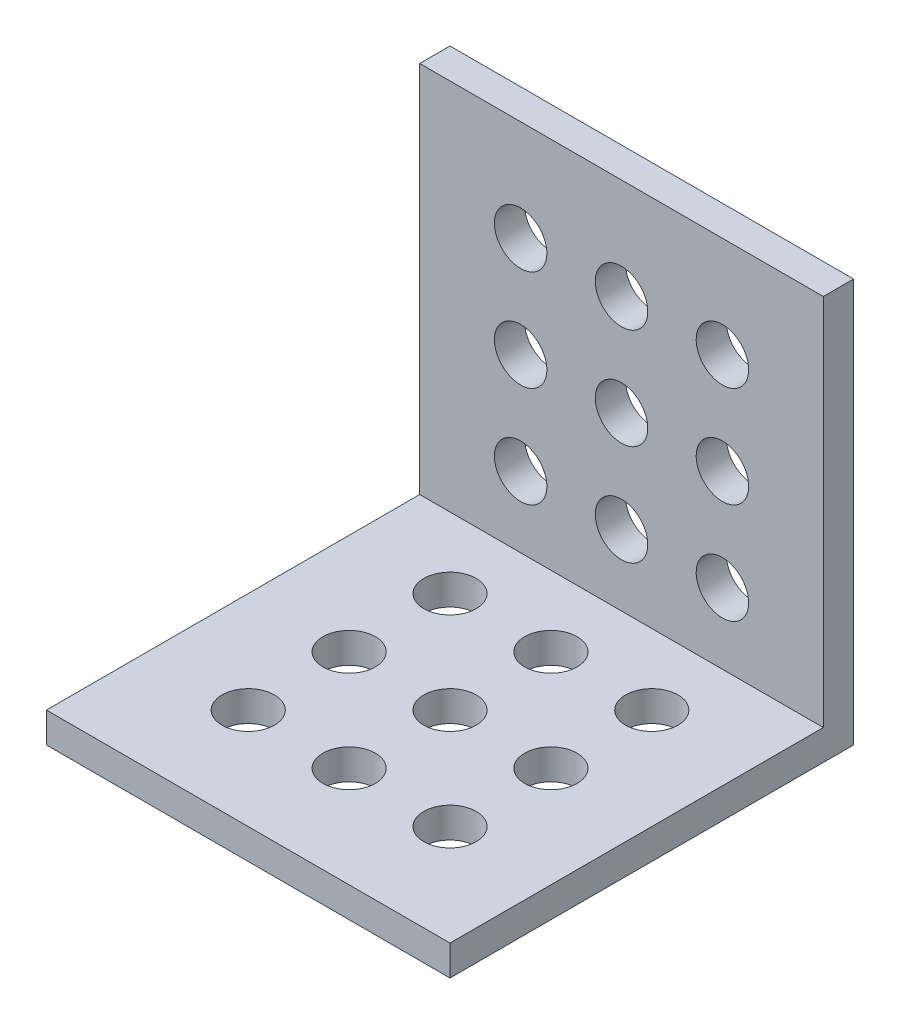
ISO-10303-21;
HEADER;
FILE_DESCRIPTION(('STEP AP214'),'2;1');
FILE_NAME('part.step','',(''),(''),'','','');
FILE_SCHEMA(('AUTOMOTIVE_DESIGN { 1 0 10303 214 1 1 1 1 }'));
ENDSEC;
DATA;
#1=APPLICATION_CONTEXT('core data for automotive mechanical design processes');
#2=APPLICATION_PROTOCOL_DEFINITION('international standard','automotive_design',2000,#1);
#3=PRODUCT_CONTEXT('',#1,'mechanical');
#4=PRODUCT('Part','Part','',(#3));
#5=PRODUCT_RELATED_PRODUCT_CATEGORY('part','',(#4));
#6=PRODUCT_DEFINITION_FORMATION('','',#4);
#7=PRODUCT_DEFINITION_CONTEXT('part definition',#1,'design');
#8=PRODUCT_DEFINITION('design','',#6,#7);
#9=PRODUCT_DEFINITION_SHAPE('','',#8);
#10=(LENGTH_UNIT() NAMED_UNIT(*) SI_UNIT(.MILLI.,.METRE.));
#11=(NAMED_UNIT(*) PLANE_ANGLE_UNIT() SI_UNIT($,.RADIAN.));
#12=(NAMED_UNIT(*) SI_UNIT($,.STERADIAN.) SOLID_ANGLE_UNIT());
#13=UNCERTAINTY_MEASURE_WITH_UNIT(LENGTH_MEASURE(1.E-05),#10,'distance_accuracy_value','');
#14=(GEOMETRIC_REPRESENTATION_CONTEXT(3) GLOBAL_UNCERTAINTY_ASSIGNED_CONTEXT((#13)) GLOBAL_UNIT_ASSIGNED_CONTEXT((#10,
#11,#12)) REPRESENTATION_CONTEXT('',''));
#15=CARTESIAN_POINT('',(0.,0.,0.));
#16=DIRECTION('',(0.,0.,1.));
#17=DIRECTION('',(1.,0.,0.));
#18=AXIS2_PLACEMENT_3D('',#15,#16,#17);
#19=CARTESIAN_POINT('',(-40.,0.,-40.));
#20=DIRECTION('',(0.,-1.,0.));
#21=DIRECTION('',(0.,0.,-1.));
#22=AXIS2_PLACEMENT_3D('',#19,#20,#21);
#23=PLANE('',#22);
#24=CARTESIAN_POINT('',(-20.,0.,-10.));
#25=DIRECTION('',(0.,1.,0.));
#26=DIRECTION('',(0.,0.,1.));
#27=AXIS2_PLACEMENT_3D('',#24,#25,#26);
#28=CIRCLE('',#27,2.6);
#29=CARTESIAN_POINT('',(-20.,0.,-7.40000000000001));
#30=VERTEX_POINT('',#29);
#31=EDGE_CURVE('E248',#30,#30,#28,.T.);
#32=ORIENTED_EDGE('',*,*,#31,.T.);
#33=EDGE_LOOP('',(#32));
#34=FACE_BOUND('',#33,.T.);
#35=CARTESIAN_POINT('',(-10.,0.,-10.));
#36=DIRECTION('',(0.,1.,0.));
#37=DIRECTION('',(0.,0.,1.));
#38=AXIS2_PLACEMENT_3D('',#35,#36,#37);
#39=CIRCLE('',#38,2.6);
#40=CARTESIAN_POINT('',(-10.,0.,-7.4));
#41=VERTEX_POINT('',#40);
#42=EDGE_CURVE('E254',#41,#41,#39,.T.);
#43=ORIENTED_EDGE('',*,*,#42,.T.);
#44=EDGE_LOOP('',(#43));
#45=FACE_BOUND('',#44,.T.);
#46=CARTESIAN_POINT('',(-20.,0.,-20.));
#47=DIRECTION('',(0.,1.,0.));
#48=DIRECTION('',(0.,0.,1.));
#49=AXIS2_PLACEMENT_3D('',#46,#47,#48);
#50=CIRCLE('',#49,2.6);
#51=CARTESIAN_POINT('',(-20.,0.,-17.4));
#52=VERTEX_POINT('',#51);
#53=EDGE_CURVE('E260',#52,#52,#50,.T.);
#54=ORIENTED_EDGE('',*,*,#53,.T.);
#55=EDGE_LOOP('',(#54));
#56=FACE_BOUND('',#55,.T.);
#57=CARTESIAN_POINT('',(-10.,0.,-20.));
#58=DIRECTION('',(0.,1.,0.));
#59=DIRECTION('',(0.,0.,1.));
#60=AXIS2_PLACEMENT_3D('',#57,#58,#59);
#61=CIRCLE('',#60,2.6);
#62=CARTESIAN_POINT('',(-10.,0.,-17.4));
#63=VERTEX_POINT('',#62);
#64=EDGE_CURVE('E226',#63,#63,#61,.T.);
#65=ORIENTED_EDGE('',*,*,#64,.T.);
#66=EDGE_LOOP('',(#65));
#67=FACE_BOUND('',#66,.T.);
#68=CARTESIAN_POINT('',(-20.0000000000001,0.,-30.));
#69=DIRECTION('',(0.,1.,0.));
#70=DIRECTION('',(0.,0.,1.));
#71=AXIS2_PLACEMENT_3D('',#68,#69,#70);
#72=CIRCLE('',#71,2.6);
#73=CARTESIAN_POINT('',(-20.0000000000001,0.,-27.4));
#74=VERTEX_POINT('',#73);
#75=EDGE_CURVE('E227',#74,#74,#72,.T.);
#76=ORIENTED_EDGE('',*,*,#75,.T.);
#77=EDGE_LOOP('',(#76));
#78=FACE_BOUND('',#77,.T.);
#79=CARTESIAN_POINT('',(-10.0000000000001,0.,-30.));
#80=DIRECTION('',(0.,1.,0.));
#81=DIRECTION('',(0.,0.,1.));
#82=AXIS2_PLACEMENT_3D('',#79,#80,#81);
#83=CIRCLE('',#82,2.6);
#84=CARTESIAN_POINT('',(-10.0000000000001,0.,-27.4));
#85=VERTEX_POINT('',#84);
#86=EDGE_CURVE('E233',#85,#85,#83,.T.);
#87=ORIENTED_EDGE('',*,*,#86,.T.);
#88=EDGE_LOOP('',(#87));
#89=FACE_BOUND('',#88,.T.);
#90=CARTESIAN_POINT('',(-30.,0.,-20.));
#91=DIRECTION('',(0.,1.,0.));
#92=DIRECTION('',(0.,0.,1.));
#93=AXIS2_PLACEMENT_3D('',#90,#91,#92);
#94=CIRCLE('',#93,2.6);
#95=CARTESIAN_POINT('',(-30.,0.,-17.4));
#96=VERTEX_POINT('',#95);
#97=EDGE_CURVE('E239',#96,#96,#94,.T.);
#98=ORIENTED_EDGE('',*,*,#97,.T.);
#99=EDGE_LOOP('',(#98));
#100=FACE_BOUND('',#99,.T.);
#101=CARTESIAN_POINT('',(-30.0000000000001,0.,-30.));
#102=DIRECTION('',(0.,1.,0.));
#103=DIRECTION('',(0.,0.,1.));
#104=AXIS2_PLACEMENT_3D('',#101,#102,#103);
#105=CIRCLE('',#104,2.6);
#106=CARTESIAN_POINT('',(-30.0000000000001,0.,-27.4));
#107=VERTEX_POINT('',#106);
#108=EDGE_CURVE('E211',#107,#107,#105,.T.);
#109=ORIENTED_EDGE('',*,*,#108,.T.);
#110=EDGE_LOOP('',(#109));
#111=FACE_BOUND('',#110,.T.);
#112=CARTESIAN_POINT('',(-30.,0.,-10.));
#113=DIRECTION('',(0.,1.,0.));
#114=DIRECTION('',(0.,0.,1.));
#115=AXIS2_PLACEMENT_3D('',#112,#113,#114);
#116=CIRCLE('',#115,2.6);
#117=CARTESIAN_POINT('',(-30.,0.,-7.4));
#118=VERTEX_POINT('',#117);
#119=EDGE_CURVE('E132',#118,#118,#116,.T.);
#120=ORIENTED_EDGE('',*,*,#119,.T.);
#121=EDGE_LOOP('',(#120));
#122=FACE_BOUND('',#121,.T.);
#123=DIRECTION('',(0.,0.,-1.));
#124=VECTOR('',#123,1.);
#125=CARTESIAN_POINT('',(0.,0.,-40.));
#126=LINE('',#125,#124);
#127=CARTESIAN_POINT('',(0.,0.,0.));
#128=VERTEX_POINT('',#127);
#129=CARTESIAN_POINT('',(0.,0.,-40.));
#130=VERTEX_POINT('',#129);
#131=EDGE_CURVE('E128',#128,#130,#126,.T.);
#132=ORIENTED_EDGE('',*,*,#131,.F.);
#133=DIRECTION('',(1.,0.,0.));
#134=VECTOR('',#133,1.);
#135=CARTESIAN_POINT('',(-40.,0.,0.));
#136=LINE('',#135,#134);
#137=CARTESIAN_POINT('',(-40.,0.,0.));
#138=VERTEX_POINT('',#137);
#139=EDGE_CURVE('E11',#138,#128,#136,.T.);
#140=ORIENTED_EDGE('',*,*,#139,.F.);
#141=DIRECTION('',(0.,0.,-1.));
#142=VECTOR('',#141,1.);
#143=CARTESIAN_POINT('',(-40.,0.,-40.));
#144=LINE('',#143,#142);
#145=CARTESIAN_POINT('',(-40.,0.,-40.));
#146=VERTEX_POINT('',#145);
#147=EDGE_CURVE('E143',#138,#146,#144,.T.);
#148=ORIENTED_EDGE('',*,*,#147,.T.);
#149=DIRECTION('',(1.,0.,0.));
#150=VECTOR('',#149,1.);
#151=CARTESIAN_POINT('',(-40.,0.,-40.));
#152=LINE('',#151,#150);
#153=EDGE_CURVE('E46',#146,#130,#152,.T.);
#154=ORIENTED_EDGE('',*,*,#153,.T.);
#155=EDGE_LOOP('',(#132,#140,#148,#154));
#156=FACE_BOUND('',#155,.T.);
#157=ADVANCED_FACE('F43',(#34,#45,#56,#67,#78,#89,#100,#111,#122,#156),#23,.T.);
#158=CARTESIAN_POINT('',(-40.,0.,0.));
#159=DIRECTION('',(0.,0.,1.));
#160=DIRECTION('',(1.,0.,0.));
#161=AXIS2_PLACEMENT_3D('',#158,#159,#160);
#162=PLANE('',#161);
#163=DIRECTION('',(0.,-1.,0.));
#164=VECTOR('',#163,1.);
#165=CARTESIAN_POINT('',(0.,0.,0.));
#166=LINE('',#165,#164);
#167=CARTESIAN_POINT('',(0.,3.,0.));
#168=VERTEX_POINT('',#167);
#169=EDGE_CURVE('E141',#168,#128,#166,.T.);
#170=ORIENTED_EDGE('',*,*,#169,.F.);
#171=DIRECTION('',(1.,0.,0.));
#172=VECTOR('',#171,1.);
#173=CARTESIAN_POINT('',(-40.,3.,0.));
#174=LINE('',#173,#172);
#175=CARTESIAN_POINT('',(-40.,3.,0.));
#176=VERTEX_POINT('',#175);
#177=EDGE_CURVE('E52',#176,#168,#174,.T.);
#178=ORIENTED_EDGE('',*,*,#177,.F.);
#179=DIRECTION('',(0.,-1.,0.));
#180=VECTOR('',#179,1.);
#181=CARTESIAN_POINT('',(-40.,0.,0.));
#182=LINE('',#181,#180);
#183=EDGE_CURVE('E118',#176,#138,#182,.T.);
#184=ORIENTED_EDGE('',*,*,#183,.T.);
#185=ORIENTED_EDGE('',*,*,#139,.T.);
#186=EDGE_LOOP('',(#170,#178,#184,#185));
#187=FACE_BOUND('',#186,.T.);
#188=ADVANCED_FACE('F151',(#187),#162,.T.);
#189=CARTESIAN_POINT('',(-40.,3.,0.));
#190=DIRECTION('',(0.,1.,0.));
#191=DIRECTION('',(0.,0.,1.));
#192=AXIS2_PLACEMENT_3D('',#189,#190,#191);
#193=PLANE('',#192);
#194=CARTESIAN_POINT('',(-20.,3.,-10.));
#195=DIRECTION('',(0.,1.,0.));
#196=DIRECTION('',(0.,0.,1.));
#197=AXIS2_PLACEMENT_3D('',#194,#195,#196);
#198=CIRCLE('',#197,2.6);
#199=CARTESIAN_POINT('',(-20.,3.,-7.40000000000001));
#200=VERTEX_POINT('',#199);
#201=EDGE_CURVE('E244',#200,#200,#198,.T.);
#202=ORIENTED_EDGE('',*,*,#201,.F.);
#203=EDGE_LOOP('',(#202));
#204=FACE_BOUND('',#203,.T.);
#205=CARTESIAN_POINT('',(-10.,3.,-10.));
#206=DIRECTION('',(0.,1.,0.));
#207=DIRECTION('',(0.,0.,1.));
#208=AXIS2_PLACEMENT_3D('',#205,#206,#207);
#209=CIRCLE('',#208,2.6);
#210=CARTESIAN_POINT('',(-10.,3.,-7.4));
#211=VERTEX_POINT('',#210);
#212=EDGE_CURVE('E251',#211,#211,#209,.T.);
#213=ORIENTED_EDGE('',*,*,#212,.F.);
#214=EDGE_LOOP('',(#213));
#215=FACE_BOUND('',#214,.T.);
#216=CARTESIAN_POINT('',(-20.,3.,-20.));
#217=DIRECTION('',(0.,1.,0.));
#218=DIRECTION('',(0.,0.,1.));
#219=AXIS2_PLACEMENT_3D('',#216,#217,#218);
#220=CIRCLE('',#219,2.6);
#221=CARTESIAN_POINT('',(-20.,3.,-17.4));
#222=VERTEX_POINT('',#221);
#223=EDGE_CURVE('E257',#222,#222,#220,.T.);
#224=ORIENTED_EDGE('',*,*,#223,.F.);
#225=EDGE_LOOP('',(#224));
#226=FACE_BOUND('',#225,.T.);
#227=CARTESIAN_POINT('',(-10.,3.,-20.));
#228=DIRECTION('',(0.,1.,0.));
#229=DIRECTION('',(0.,0.,1.));
#230=AXIS2_PLACEMENT_3D('',#227,#228,#229);
#231=CIRCLE('',#230,2.6);
#232=CARTESIAN_POINT('',(-10.,3.,-17.4));
#233=VERTEX_POINT('',#232);
#234=EDGE_CURVE('E263',#233,#233,#231,.T.);
#235=ORIENTED_EDGE('',*,*,#234,.F.);
#236=EDGE_LOOP('',(#235));
#237=FACE_BOUND('',#236,.T.);
#238=CARTESIAN_POINT('',(-20.0000000000001,3.,-30.));
#239=DIRECTION('',(0.,1.,0.));
#240=DIRECTION('',(0.,0.,1.));
#241=AXIS2_PLACEMENT_3D('',#238,#239,#240);
#242=CIRCLE('',#241,2.6);
#243=CARTESIAN_POINT('',(-20.0000000000001,3.,-27.4));
#244=VERTEX_POINT('',#243);
#245=EDGE_CURVE('E223',#244,#244,#242,.T.);
#246=ORIENTED_EDGE('',*,*,#245,.F.);
#247=EDGE_LOOP('',(#246));
#248=FACE_BOUND('',#247,.T.);
#249=CARTESIAN_POINT('',(-10.0000000000001,3.,-30.));
#250=DIRECTION('',(0.,1.,0.));
#251=DIRECTION('',(0.,0.,1.));
#252=AXIS2_PLACEMENT_3D('',#249,#250,#251);
#253=CIRCLE('',#252,2.6);
#254=CARTESIAN_POINT('',(-10.0000000000001,3.,-27.4));
#255=VERTEX_POINT('',#254);
#256=EDGE_CURVE('E230',#255,#255,#253,.T.);
#257=ORIENTED_EDGE('',*,*,#256,.F.);
#258=EDGE_LOOP('',(#257));
#259=FACE_BOUND('',#258,.T.);
#260=CARTESIAN_POINT('',(-30.,3.,-20.));
#261=DIRECTION('',(0.,1.,0.));
#262=DIRECTION('',(0.,0.,1.));
#263=AXIS2_PLACEMENT_3D('',#260,#261,#262);
#264=CIRCLE('',#263,2.6);
#265=CARTESIAN_POINT('',(-30.,3.,-17.4));
#266=VERTEX_POINT('',#265);
#267=EDGE_CURVE('E236',#266,#266,#264,.T.);
#268=ORIENTED_EDGE('',*,*,#267,.F.);
#269=EDGE_LOOP('',(#268));
#270=FACE_BOUND('',#269,.T.);
#271=CARTESIAN_POINT('',(-30.0000000000001,3.,-30.));
#272=DIRECTION('',(0.,1.,0.));
#273=DIRECTION('',(0.,0.,1.));
#274=AXIS2_PLACEMENT_3D('',#271,#272,#273);
#275=CIRCLE('',#274,2.6);
#276=CARTESIAN_POINT('',(-30.0000000000001,3.,-27.4));
#277=VERTEX_POINT('',#276);
#278=EDGE_CURVE('E215',#277,#277,#275,.T.);
#279=ORIENTED_EDGE('',*,*,#278,.F.);
#280=EDGE_LOOP('',(#279));
#281=FACE_BOUND('',#280,.T.);
#282=CARTESIAN_POINT('',(-30.,3.,-10.));
#283=DIRECTION('',(0.,1.,0.));
#284=DIRECTION('',(0.,0.,1.));
#285=AXIS2_PLACEMENT_3D('',#282,#283,#284);
#286=CIRCLE('',#285,2.6);
#287=CARTESIAN_POINT('',(-30.,3.,-7.4));
#288=VERTEX_POINT('',#287);
#289=EDGE_CURVE('E247',#288,#288,#286,.T.);
#290=ORIENTED_EDGE('',*,*,#289,.F.);
#291=EDGE_LOOP('',(#290));
#292=FACE_BOUND('',#291,.T.);
#293=DIRECTION('',(0.,0.,1.));
#294=VECTOR('',#293,1.);
#295=CARTESIAN_POINT('',(0.,3.,0.));
#296=LINE('',#295,#294);
#297=CARTESIAN_POINT('',(0.,3.,-37.));
#298=VERTEX_POINT('',#297);
#299=EDGE_CURVE('E105',#298,#168,#296,.T.);
#300=ORIENTED_EDGE('',*,*,#299,.F.);
#301=DIRECTION('',(1.,0.,0.));
#302=VECTOR('',#301,1.);
#303=CARTESIAN_POINT('',(-40.,3.,-37.));
#304=LINE('',#303,#302);
#305=CARTESIAN_POINT('',(-40.,3.,-37.));
#306=VERTEX_POINT('',#305);
#307=EDGE_CURVE('E100',#306,#298,#304,.T.);
#308=ORIENTED_EDGE('',*,*,#307,.F.);
#309=DIRECTION('',(0.,0.,1.));
#310=VECTOR('',#309,1.);
#311=CARTESIAN_POINT('',(-40.,3.,0.));
#312=LINE('',#311,#310);
#313=EDGE_CURVE('E103',#306,#176,#312,.T.);
#314=ORIENTED_EDGE('',*,*,#313,.T.);
#315=ORIENTED_EDGE('',*,*,#177,.T.);
#316=EDGE_LOOP('',(#300,#308,#314,#315));
#317=FACE_BOUND('',#316,.T.);
#318=ADVANCED_FACE('F102',(#204,#215,#226,#237,#248,#259,#270,#281,#292,#317),#193,.T.);
#319=CARTESIAN_POINT('',(-40.,3.,-37.));
#320=DIRECTION('',(0.,0.,1.));
#321=DIRECTION('',(1.,0.,0.));
#322=AXIS2_PLACEMENT_3D('',#319,#320,#321);
#323=PLANE('',#322);
#324=CARTESIAN_POINT('',(-20.,30.,-36.9999999999999));
#325=DIRECTION('',(0.,0.,-1.));
#326=DIRECTION('',(0.,1.,0.));
#327=AXIS2_PLACEMENT_3D('',#324,#325,#326);
#328=CIRCLE('',#327,2.6);
#329=CARTESIAN_POINT('',(-20.,32.6,-36.9999999999999));
#330=VERTEX_POINT('',#329);
#331=EDGE_CURVE('E373',#330,#330,#328,.T.);
#332=ORIENTED_EDGE('',*,*,#331,.T.);
#333=EDGE_LOOP('',(#332));
#334=FACE_BOUND('',#333,.T.);
#335=CARTESIAN_POINT('',(-10.,30.,-36.9999999999999));
#336=DIRECTION('',(0.,0.,-1.));
#337=DIRECTION('',(0.,1.,0.));
#338=AXIS2_PLACEMENT_3D('',#335,#336,#337);
#339=CIRCLE('',#338,2.6);
#340=CARTESIAN_POINT('',(-10.,32.6,-36.9999999999999));
#341=VERTEX_POINT('',#340);
#342=EDGE_CURVE('E377',#341,#341,#339,.T.);
#343=ORIENTED_EDGE('',*,*,#342,.T.);
#344=EDGE_LOOP('',(#343));
#345=FACE_BOUND('',#344,.T.);
#346=CARTESIAN_POINT('',(-20.,20.,-36.9999999999999));
#347=DIRECTION('',(0.,0.,-1.));
#348=DIRECTION('',(0.,1.,0.));
#349=AXIS2_PLACEMENT_3D('',#346,#347,#348);
#350=CIRCLE('',#349,2.6);
#351=CARTESIAN_POINT('',(-20.,22.6,-36.9999999999999));
#352=VERTEX_POINT('',#351);
#353=EDGE_CURVE('E381',#352,#352,#350,.T.);
#354=ORIENTED_EDGE('',*,*,#353,.T.);
#355=EDGE_LOOP('',(#354));
#356=FACE_BOUND('',#355,.T.);
#357=CARTESIAN_POINT('',(-10.,20.,-36.9999999999999));
#358=DIRECTION('',(0.,0.,-1.));
#359=DIRECTION('',(0.,1.,0.));
#360=AXIS2_PLACEMENT_3D('',#357,#358,#359);
#361=CIRCLE('',#360,2.6);
#362=CARTESIAN_POINT('',(-10.,22.6,-36.9999999999999));
#363=VERTEX_POINT('',#362);
#364=EDGE_CURVE('E220',#363,#363,#361,.T.);
#365=ORIENTED_EDGE('',*,*,#364,.T.);
#366=EDGE_LOOP('',(#365));
#367=FACE_BOUND('',#366,.T.);
#368=CARTESIAN_POINT('',(-20.0000000000001,9.99999999999998,-37.));
#369=DIRECTION('',(0.,0.,-1.));
#370=DIRECTION('',(0.,1.,0.));
#371=AXIS2_PLACEMENT_3D('',#368,#369,#370);
#372=CIRCLE('',#371,2.6);
#373=CARTESIAN_POINT('',(-20.0000000000001,12.6,-37.));
#374=VERTEX_POINT('',#373);
#375=EDGE_CURVE('E355',#374,#374,#372,.T.);
#376=ORIENTED_EDGE('',*,*,#375,.T.);
#377=EDGE_LOOP('',(#376));
#378=FACE_BOUND('',#377,.T.);
#379=CARTESIAN_POINT('',(-10.0000000000001,9.99999999999998,-37.));
#380=DIRECTION('',(0.,0.,-1.));
#381=DIRECTION('',(0.,1.,0.));
#382=AXIS2_PLACEMENT_3D('',#379,#380,#381);
#383=CIRCLE('',#382,2.6);
#384=CARTESIAN_POINT('',(-10.0000000000001,12.6,-37.));
#385=VERTEX_POINT('',#384);
#386=EDGE_CURVE('E359',#385,#385,#383,.T.);
#387=ORIENTED_EDGE('',*,*,#386,.T.);
#388=EDGE_LOOP('',(#387));
#389=FACE_BOUND('',#388,.T.);
#390=CARTESIAN_POINT('',(-30.,20.,-36.9999999999999));
#391=DIRECTION('',(0.,0.,-1.));
#392=DIRECTION('',(0.,1.,0.));
#393=AXIS2_PLACEMENT_3D('',#390,#391,#392);
#394=CIRCLE('',#393,2.6);
#395=CARTESIAN_POINT('',(-30.,22.6,-36.9999999999999));
#396=VERTEX_POINT('',#395);
#397=EDGE_CURVE('E365',#396,#396,#394,.T.);
#398=ORIENTED_EDGE('',*,*,#397,.T.);
#399=EDGE_LOOP('',(#398));
#400=FACE_BOUND('',#399,.T.);
#401=CARTESIAN_POINT('',(-30.0000000000001,9.99999999999998,-37.));
#402=DIRECTION('',(0.,0.,-1.));
#403=DIRECTION('',(0.,1.,0.));
#404=AXIS2_PLACEMENT_3D('',#401,#402,#403);
#405=CIRCLE('',#404,2.6);
#406=CARTESIAN_POINT('',(-30.0000000000001,12.6,-37.));
#407=VERTEX_POINT('',#406);
#408=EDGE_CURVE('E369',#407,#407,#405,.T.);
#409=ORIENTED_EDGE('',*,*,#408,.T.);
#410=EDGE_LOOP('',(#409));
#411=FACE_BOUND('',#410,.T.);
#412=CARTESIAN_POINT('',(-30.,30.,-36.9999999999999));
#413=DIRECTION('',(0.,0.,-1.));
#414=DIRECTION('',(0.,1.,0.));
#415=AXIS2_PLACEMENT_3D('',#412,#413,#414);
#416=CIRCLE('',#415,2.6);
#417=CARTESIAN_POINT('',(-30.,32.6,-36.9999999999999));
#418=VERTEX_POINT('',#417);
#419=EDGE_CURVE('E212',#418,#418,#416,.T.);
#420=ORIENTED_EDGE('',*,*,#419,.T.);
#421=EDGE_LOOP('',(#420));
#422=FACE_BOUND('',#421,.T.);
#423=DIRECTION('',(0.,-1.,0.));
#424=VECTOR('',#423,1.);
#425=CARTESIAN_POINT('',(0.,3.,-37.));
#426=LINE('',#425,#424);
#427=CARTESIAN_POINT('',(0.,40.,-37.));
#428=VERTEX_POINT('',#427);
#429=EDGE_CURVE('E138',#428,#298,#426,.T.);
#430=ORIENTED_EDGE('',*,*,#429,.F.);
#431=DIRECTION('',(1.,0.,0.));
#432=VECTOR('',#431,1.);
#433=CARTESIAN_POINT('',(-40.,40.,-37.));
#434=LINE('',#433,#432);
#435=CARTESIAN_POINT('',(-40.,40.,-37.));
#436=VERTEX_POINT('',#435);
#437=EDGE_CURVE('E110',#436,#428,#434,.T.);
#438=ORIENTED_EDGE('',*,*,#437,.F.);
#439=DIRECTION('',(0.,-1.,0.));
#440=VECTOR('',#439,1.);
#441=CARTESIAN_POINT('',(-40.,3.,-37.));
#442=LINE('',#441,#440);
#443=EDGE_CURVE('E116',#436,#306,#442,.T.);
#444=ORIENTED_EDGE('',*,*,#443,.T.);
#445=ORIENTED_EDGE('',*,*,#307,.T.);
#446=EDGE_LOOP('',(#430,#438,#444,#445));
#447=FACE_BOUND('',#446,.T.);
#448=ADVANCED_FACE('F120',(#334,#345,#356,#367,#378,#389,#400,#411,#422,#447),#323,.T.);
#449=CARTESIAN_POINT('',(-40.,40.,-37.));
#450=DIRECTION('',(0.,1.,0.));
#451=DIRECTION('',(0.,0.,1.));
#452=AXIS2_PLACEMENT_3D('',#449,#450,#451);
#453=PLANE('',#452);
#454=DIRECTION('',(0.,0.,1.));
#455=VECTOR('',#454,1.);
#456=CARTESIAN_POINT('',(0.,40.,-37.));
#457=LINE('',#456,#455);
#458=CARTESIAN_POINT('',(0.,40.,-40.));
#459=VERTEX_POINT('',#458);
#460=EDGE_CURVE('E135',#459,#428,#457,.T.);
#461=ORIENTED_EDGE('',*,*,#460,.F.);
#462=DIRECTION('',(1.,0.,0.));
#463=VECTOR('',#462,1.);
#464=CARTESIAN_POINT('',(-40.,40.,-40.));
#465=LINE('',#464,#463);
#466=CARTESIAN_POINT('',(-40.,40.,-40.));
#467=VERTEX_POINT('',#466);
#468=EDGE_CURVE('E146',#467,#459,#465,.T.);
#469=ORIENTED_EDGE('',*,*,#468,.F.);
#470=DIRECTION('',(0.,0.,1.));
#471=VECTOR('',#470,1.);
#472=CARTESIAN_POINT('',(-40.,40.,-37.));
#473=LINE('',#472,#471);
#474=EDGE_CURVE('E121',#467,#436,#473,.T.);
#475=ORIENTED_EDGE('',*,*,#474,.T.);
#476=ORIENTED_EDGE('',*,*,#437,.T.);
#477=EDGE_LOOP('',(#461,#469,#475,#476));
#478=FACE_BOUND('',#477,.T.);
#479=ADVANCED_FACE('F166',(#478),#453,.T.);
#480=CARTESIAN_POINT('',(-40.,40.,-40.));
#481=DIRECTION('',(0.,0.,-1.));
#482=DIRECTION('',(0.,1.,0.));
#483=AXIS2_PLACEMENT_3D('',#480,#481,#482);
#484=PLANE('',#483);
#485=CARTESIAN_POINT('',(-20.,30.,-40.));
#486=DIRECTION('',(0.,0.,-1.));
#487=DIRECTION('',(0.,1.,0.));
#488=AXIS2_PLACEMENT_3D('',#485,#486,#487);
#489=CIRCLE('',#488,2.6);
#490=CARTESIAN_POINT('',(-20.,32.6,-40.));
#491=VERTEX_POINT('',#490);
#492=EDGE_CURVE('E178',#491,#491,#489,.T.);
#493=ORIENTED_EDGE('',*,*,#492,.F.);
#494=EDGE_LOOP('',(#493));
#495=FACE_BOUND('',#494,.T.);
#496=CARTESIAN_POINT('',(-10.,30.,-40.));
#497=DIRECTION('',(0.,0.,-1.));
#498=DIRECTION('',(0.,1.,0.));
#499=AXIS2_PLACEMENT_3D('',#496,#497,#498);
#500=CIRCLE('',#499,2.6);
#501=CARTESIAN_POINT('',(-10.,32.6,-40.));
#502=VERTEX_POINT('',#501);
#503=EDGE_CURVE('E182',#502,#502,#500,.T.);
#504=ORIENTED_EDGE('',*,*,#503,.F.);
#505=EDGE_LOOP('',(#504));
#506=FACE_BOUND('',#505,.T.);
#507=CARTESIAN_POINT('',(-20.,20.,-40.0000000000001));
#508=DIRECTION('',(0.,0.,-1.));
#509=DIRECTION('',(0.,1.,0.));
#510=AXIS2_PLACEMENT_3D('',#507,#508,#509);
#511=CIRCLE('',#510,2.6);
#512=CARTESIAN_POINT('',(-20.,22.6,-40.));
#513=VERTEX_POINT('',#512);
#514=EDGE_CURVE('E186',#513,#513,#511,.T.);
#515=ORIENTED_EDGE('',*,*,#514,.F.);
#516=EDGE_LOOP('',(#515));
#517=FACE_BOUND('',#516,.T.);
#518=CARTESIAN_POINT('',(-10.,20.,-40.0000000000001));
#519=DIRECTION('',(0.,0.,-1.));
#520=DIRECTION('',(0.,1.,0.));
#521=AXIS2_PLACEMENT_3D('',#518,#519,#520);
#522=CIRCLE('',#521,2.6);
#523=CARTESIAN_POINT('',(-10.,22.6,-40.));
#524=VERTEX_POINT('',#523);
#525=EDGE_CURVE('E190',#524,#524,#522,.T.);
#526=ORIENTED_EDGE('',*,*,#525,.F.);
#527=EDGE_LOOP('',(#526));
#528=FACE_BOUND('',#527,.T.);
#529=CARTESIAN_POINT('',(-20.0000000000001,9.99999999999999,-40.0000000000001));
#530=DIRECTION('',(0.,0.,-1.));
#531=DIRECTION('',(0.,1.,0.));
#532=AXIS2_PLACEMENT_3D('',#529,#530,#531);
#533=CIRCLE('',#532,2.6);
#534=CARTESIAN_POINT('',(-20.0000000000001,12.6,-40.0000000000001));
#535=VERTEX_POINT('',#534);
#536=EDGE_CURVE('E194',#535,#535,#533,.T.);
#537=ORIENTED_EDGE('',*,*,#536,.F.);
#538=EDGE_LOOP('',(#537));
#539=FACE_BOUND('',#538,.T.);
#540=CARTESIAN_POINT('',(-10.0000000000001,9.99999999999999,-40.0000000000001));
#541=DIRECTION('',(0.,0.,-1.));
#542=DIRECTION('',(0.,1.,0.));
#543=AXIS2_PLACEMENT_3D('',#540,#541,#542);
#544=CIRCLE('',#543,2.6);
#545=CARTESIAN_POINT('',(-10.0000000000001,12.6,-40.0000000000001));
#546=VERTEX_POINT('',#545);
#547=EDGE_CURVE('E198',#546,#546,#544,.T.);
#548=ORIENTED_EDGE('',*,*,#547,.F.);
#549=EDGE_LOOP('',(#548));
#550=FACE_BOUND('',#549,.T.);
#551=CARTESIAN_POINT('',(-30.,20.,-40.0000000000001));
#552=DIRECTION('',(0.,0.,-1.));
#553=DIRECTION('',(0.,1.,0.));
#554=AXIS2_PLACEMENT_3D('',#551,#552,#553);
#555=CIRCLE('',#554,2.6);
#556=CARTESIAN_POINT('',(-30.,22.6,-40.));
#557=VERTEX_POINT('',#556);
#558=EDGE_CURVE('E202',#557,#557,#555,.T.);
#559=ORIENTED_EDGE('',*,*,#558,.F.);
#560=EDGE_LOOP('',(#559));
#561=FACE_BOUND('',#560,.T.);
#562=CARTESIAN_POINT('',(-30.0000000000001,9.99999999999999,-40.0000000000001));
#563=DIRECTION('',(0.,0.,-1.));
#564=DIRECTION('',(0.,1.,0.));
#565=AXIS2_PLACEMENT_3D('',#562,#563,#564);
#566=CIRCLE('',#565,2.6);
#567=CARTESIAN_POINT('',(-30.0000000000001,12.6,-40.0000000000001));
#568=VERTEX_POINT('',#567);
#569=EDGE_CURVE('E206',#568,#568,#566,.T.);
#570=ORIENTED_EDGE('',*,*,#569,.F.);
#571=EDGE_LOOP('',(#570));
#572=FACE_BOUND('',#571,.T.);
#573=CARTESIAN_POINT('',(-30.,30.,-40.));
#574=DIRECTION('',(0.,0.,-1.));
#575=DIRECTION('',(0.,1.,0.));
#576=AXIS2_PLACEMENT_3D('',#573,#574,#575);
#577=CIRCLE('',#576,2.6);
#578=CARTESIAN_POINT('',(-30.,32.6,-40.));
#579=VERTEX_POINT('',#578);
#580=EDGE_CURVE('E209',#579,#579,#577,.T.);
#581=ORIENTED_EDGE('',*,*,#580,.F.);
#582=EDGE_LOOP('',(#581));
#583=FACE_BOUND('',#582,.T.);
#584=DIRECTION('',(0.,1.,0.));
#585=VECTOR('',#584,1.);
#586=CARTESIAN_POINT('',(0.,40.,-40.));
#587=LINE('',#586,#585);
#588=EDGE_CURVE('E131',#130,#459,#587,.T.);
#589=ORIENTED_EDGE('',*,*,#588,.F.);
#590=ORIENTED_EDGE('',*,*,#153,.F.);
#591=DIRECTION('',(0.,1.,0.));
#592=VECTOR('',#591,1.);
#593=CARTESIAN_POINT('',(-40.,40.,-40.));
#594=LINE('',#593,#592);
#595=EDGE_CURVE('E123',#146,#467,#594,.T.);
#596=ORIENTED_EDGE('',*,*,#595,.T.);
#597=ORIENTED_EDGE('',*,*,#468,.T.);
#598=EDGE_LOOP('',(#589,#590,#596,#597));
#599=FACE_BOUND('',#598,.T.);
#600=ADVANCED_FACE('F148',(#495,#506,#517,#528,#539,#550,#561,#572,#583,#599),#484,.T.);
#601=CARTESIAN_POINT('',(-40.,0.,0.));
#602=DIRECTION('',(-1.,0.,0.));
#603=DIRECTION('',(0.,0.,1.));
#604=AXIS2_PLACEMENT_3D('',#601,#602,#603);
#605=PLANE('',#604);
#606=ORIENTED_EDGE('',*,*,#147,.F.);
#607=ORIENTED_EDGE('',*,*,#183,.F.);
#608=ORIENTED_EDGE('',*,*,#313,.F.);
#609=ORIENTED_EDGE('',*,*,#443,.F.);
#610=ORIENTED_EDGE('',*,*,#474,.F.);
#611=ORIENTED_EDGE('',*,*,#595,.F.);
#612=EDGE_LOOP('',(#606,#607,#608,#609,#610,#611));
#613=FACE_BOUND('',#612,.T.);
#614=ADVANCED_FACE('F114',(#613),#605,.T.);
#615=CARTESIAN_POINT('',(0.,0.,0.));
#616=DIRECTION('',(-1.,0.,0.));
#617=DIRECTION('',(0.,0.,1.));
#618=AXIS2_PLACEMENT_3D('',#615,#616,#617);
#619=PLANE('',#618);
#620=ORIENTED_EDGE('',*,*,#131,.T.);
#621=ORIENTED_EDGE('',*,*,#588,.T.);
#622=ORIENTED_EDGE('',*,*,#460,.T.);
#623=ORIENTED_EDGE('',*,*,#429,.T.);
#624=ORIENTED_EDGE('',*,*,#299,.T.);
#625=ORIENTED_EDGE('',*,*,#169,.T.);
#626=EDGE_LOOP('',(#620,#621,#622,#623,#624,#625));
#627=FACE_BOUND('',#626,.T.);
#628=ADVANCED_FACE('F150',(#627),#619,.F.);
#629=CARTESIAN_POINT('',(-30.,0.,-10.));
#630=DIRECTION('',(0.,1.,0.));
#631=DIRECTION('',(0.,0.,1.));
#632=AXIS2_PLACEMENT_3D('',#629,#630,#631);
#633=CYLINDRICAL_SURFACE('',#632,2.6);
#634=ORIENTED_EDGE('',*,*,#119,.F.);
#635=EDGE_LOOP('',(#634));
#636=FACE_BOUND('',#635,.T.);
#637=ORIENTED_EDGE('',*,*,#289,.T.);
#638=EDGE_LOOP('',(#637));
#639=FACE_BOUND('',#638,.T.);
#640=ADVANCED_FACE('F274',(#636,#639),#633,.F.);
#641=CARTESIAN_POINT('',(-30.0000000000001,0.,-30.));
#642=DIRECTION('',(0.,1.,0.));
#643=DIRECTION('',(0.,0.,1.));
#644=AXIS2_PLACEMENT_3D('',#641,#642,#643);
#645=CYLINDRICAL_SURFACE('',#644,2.6);
#646=ORIENTED_EDGE('',*,*,#108,.F.);
#647=EDGE_LOOP('',(#646));
#648=FACE_BOUND('',#647,.T.);
#649=ORIENTED_EDGE('',*,*,#278,.T.);
#650=EDGE_LOOP('',(#649));
#651=FACE_BOUND('',#650,.T.);
#652=ADVANCED_FACE('F277',(#648,#651),#645,.F.);
#653=CARTESIAN_POINT('',(-30.,0.,-20.));
#654=DIRECTION('',(0.,1.,0.));
#655=DIRECTION('',(0.,0.,1.));
#656=AXIS2_PLACEMENT_3D('',#653,#654,#655);
#657=CYLINDRICAL_SURFACE('',#656,2.6);
#658=ORIENTED_EDGE('',*,*,#97,.F.);
#659=EDGE_LOOP('',(#658));
#660=FACE_BOUND('',#659,.T.);
#661=ORIENTED_EDGE('',*,*,#267,.T.);
#662=EDGE_LOOP('',(#661));
#663=FACE_BOUND('',#662,.T.);
#664=ADVANCED_FACE('F284',(#660,#663),#657,.F.);
#665=CARTESIAN_POINT('',(-10.0000000000001,0.,-30.));
#666=DIRECTION('',(0.,1.,0.));
#667=DIRECTION('',(0.,0.,1.));
#668=AXIS2_PLACEMENT_3D('',#665,#666,#667);
#669=CYLINDRICAL_SURFACE('',#668,2.6);
#670=ORIENTED_EDGE('',*,*,#86,.F.);
#671=EDGE_LOOP('',(#670));
#672=FACE_BOUND('',#671,.T.);
#673=ORIENTED_EDGE('',*,*,#256,.T.);
#674=EDGE_LOOP('',(#673));
#675=FACE_BOUND('',#674,.T.);
#676=ADVANCED_FACE('F309',(#672,#675),#669,.F.);
#677=CARTESIAN_POINT('',(-20.0000000000001,0.,-30.));
#678=DIRECTION('',(0.,1.,0.));
#679=DIRECTION('',(0.,0.,1.));
#680=AXIS2_PLACEMENT_3D('',#677,#678,#679);
#681=CYLINDRICAL_SURFACE('',#680,2.6);
#682=ORIENTED_EDGE('',*,*,#75,.F.);
#683=EDGE_LOOP('',(#682));
#684=FACE_BOUND('',#683,.T.);
#685=ORIENTED_EDGE('',*,*,#245,.T.);
#686=EDGE_LOOP('',(#685));
#687=FACE_BOUND('',#686,.T.);
#688=ADVANCED_FACE('F293',(#684,#687),#681,.F.);
#689=CARTESIAN_POINT('',(-10.,0.,-20.));
#690=DIRECTION('',(0.,1.,0.));
#691=DIRECTION('',(0.,0.,1.));
#692=AXIS2_PLACEMENT_3D('',#689,#690,#691);
#693=CYLINDRICAL_SURFACE('',#692,2.6);
#694=ORIENTED_EDGE('',*,*,#64,.F.);
#695=EDGE_LOOP('',(#694));
#696=FACE_BOUND('',#695,.T.);
#697=ORIENTED_EDGE('',*,*,#234,.T.);
#698=EDGE_LOOP('',(#697));
#699=FACE_BOUND('',#698,.T.);
#700=ADVANCED_FACE('F289',(#696,#699),#693,.F.);
#701=CARTESIAN_POINT('',(-20.,0.,-20.));
#702=DIRECTION('',(0.,1.,0.));
#703=DIRECTION('',(0.,0.,1.));
#704=AXIS2_PLACEMENT_3D('',#701,#702,#703);
#705=CYLINDRICAL_SURFACE('',#704,2.6);
#706=ORIENTED_EDGE('',*,*,#53,.F.);
#707=EDGE_LOOP('',(#706));
#708=FACE_BOUND('',#707,.T.);
#709=ORIENTED_EDGE('',*,*,#223,.T.);
#710=EDGE_LOOP('',(#709));
#711=FACE_BOUND('',#710,.T.);
#712=ADVANCED_FACE('F292',(#708,#711),#705,.F.);
#713=CARTESIAN_POINT('',(-10.,0.,-10.));
#714=DIRECTION('',(0.,1.,0.));
#715=DIRECTION('',(0.,0.,1.));
#716=AXIS2_PLACEMENT_3D('',#713,#714,#715);
#717=CYLINDRICAL_SURFACE('',#716,2.6);
#718=ORIENTED_EDGE('',*,*,#42,.F.);
#719=EDGE_LOOP('',(#718));
#720=FACE_BOUND('',#719,.T.);
#721=ORIENTED_EDGE('',*,*,#212,.T.);
#722=EDGE_LOOP('',(#721));
#723=FACE_BOUND('',#722,.T.);
#724=ADVANCED_FACE('F297',(#720,#723),#717,.F.);
#725=CARTESIAN_POINT('',(-20.,0.,-10.));
#726=DIRECTION('',(0.,1.,0.));
#727=DIRECTION('',(0.,0.,1.));
#728=AXIS2_PLACEMENT_3D('',#725,#726,#727);
#729=CYLINDRICAL_SURFACE('',#728,2.6);
#730=ORIENTED_EDGE('',*,*,#31,.F.);
#731=EDGE_LOOP('',(#730));
#732=FACE_BOUND('',#731,.T.);
#733=ORIENTED_EDGE('',*,*,#201,.T.);
#734=EDGE_LOOP('',(#733));
#735=FACE_BOUND('',#734,.T.);
#736=ADVANCED_FACE('F301',(#732,#735),#729,.F.);
#737=CARTESIAN_POINT('',(-30.,30.,-40.));
#738=DIRECTION('',(0.,0.,1.));
#739=DIRECTION('',(0.,-1.,0.));
#740=AXIS2_PLACEMENT_3D('',#737,#738,#739);
#741=CYLINDRICAL_SURFACE('',#740,2.6);
#742=ORIENTED_EDGE('',*,*,#580,.T.);
#743=EDGE_LOOP('',(#742));
#744=FACE_BOUND('',#743,.T.);
#745=ORIENTED_EDGE('',*,*,#419,.F.);
#746=EDGE_LOOP('',(#745));
#747=FACE_BOUND('',#746,.T.);
#748=ADVANCED_FACE('F304',(#744,#747),#741,.F.);
#749=CARTESIAN_POINT('',(-30.0000000000001,9.99999999999999,-40.0000000000001));
#750=DIRECTION('',(0.,0.,1.));
#751=DIRECTION('',(0.,-1.,0.));
#752=AXIS2_PLACEMENT_3D('',#749,#750,#751);
#753=CYLINDRICAL_SURFACE('',#752,2.6);
#754=ORIENTED_EDGE('',*,*,#569,.T.);
#755=EDGE_LOOP('',(#754));
#756=FACE_BOUND('',#755,.T.);
#757=ORIENTED_EDGE('',*,*,#408,.F.);
#758=EDGE_LOOP('',(#757));
#759=FACE_BOUND('',#758,.T.);
#760=ADVANCED_FACE('F319',(#756,#759),#753,.F.);
#761=CARTESIAN_POINT('',(-30.,20.,-40.0000000000001));
#762=DIRECTION('',(0.,0.,1.));
#763=DIRECTION('',(0.,-1.,0.));
#764=AXIS2_PLACEMENT_3D('',#761,#762,#763);
#765=CYLINDRICAL_SURFACE('',#764,2.6);
#766=ORIENTED_EDGE('',*,*,#558,.T.);
#767=EDGE_LOOP('',(#766));
#768=FACE_BOUND('',#767,.T.);
#769=ORIENTED_EDGE('',*,*,#397,.F.);
#770=EDGE_LOOP('',(#769));
#771=FACE_BOUND('',#770,.T.);
#772=ADVANCED_FACE('F339',(#768,#771),#765,.F.);
#773=CARTESIAN_POINT('',(-10.0000000000001,9.99999999999999,-40.0000000000001));
#774=DIRECTION('',(0.,0.,1.));
#775=DIRECTION('',(0.,-1.,0.));
#776=AXIS2_PLACEMENT_3D('',#773,#774,#775);
#777=CYLINDRICAL_SURFACE('',#776,2.6);
#778=ORIENTED_EDGE('',*,*,#547,.T.);
#779=EDGE_LOOP('',(#778));
#780=FACE_BOUND('',#779,.T.);
#781=ORIENTED_EDGE('',*,*,#386,.F.);
#782=EDGE_LOOP('',(#781));
#783=FACE_BOUND('',#782,.T.);
#784=ADVANCED_FACE('F343',(#780,#783),#777,.F.);
#785=CARTESIAN_POINT('',(-20.0000000000001,9.99999999999999,-40.0000000000001));
#786=DIRECTION('',(0.,0.,1.));
#787=DIRECTION('',(0.,-1.,0.));
#788=AXIS2_PLACEMENT_3D('',#785,#786,#787);
#789=CYLINDRICAL_SURFACE('',#788,2.6);
#790=ORIENTED_EDGE('',*,*,#536,.T.);
#791=EDGE_LOOP('',(#790));
#792=FACE_BOUND('',#791,.T.);
#793=ORIENTED_EDGE('',*,*,#375,.F.);
#794=EDGE_LOOP('',(#793));
#795=FACE_BOUND('',#794,.T.);
#796=ADVANCED_FACE('F324',(#792,#795),#789,.F.);
#797=CARTESIAN_POINT('',(-10.,20.,-40.0000000000001));
#798=DIRECTION('',(0.,0.,1.));
#799=DIRECTION('',(0.,-1.,0.));
#800=AXIS2_PLACEMENT_3D('',#797,#798,#799);
#801=CYLINDRICAL_SURFACE('',#800,2.6);
#802=ORIENTED_EDGE('',*,*,#525,.T.);
#803=EDGE_LOOP('',(#802));
#804=FACE_BOUND('',#803,.T.);
#805=ORIENTED_EDGE('',*,*,#364,.F.);
#806=EDGE_LOOP('',(#805));
#807=FACE_BOUND('',#806,.T.);
#808=ADVANCED_FACE('F320',(#804,#807),#801,.F.);
#809=CARTESIAN_POINT('',(-20.,20.,-40.0000000000001));
#810=DIRECTION('',(0.,0.,1.));
#811=DIRECTION('',(0.,-1.,0.));
#812=AXIS2_PLACEMENT_3D('',#809,#810,#811);
#813=CYLINDRICAL_SURFACE('',#812,2.6);
#814=ORIENTED_EDGE('',*,*,#514,.T.);
#815=EDGE_LOOP('',(#814));
#816=FACE_BOUND('',#815,.T.);
#817=ORIENTED_EDGE('',*,*,#353,.F.);
#818=EDGE_LOOP('',(#817));
#819=FACE_BOUND('',#818,.T.);
#820=ADVANCED_FACE('F323',(#816,#819),#813,.F.);
#821=CARTESIAN_POINT('',(-10.,30.,-40.));
#822=DIRECTION('',(0.,0.,1.));
#823=DIRECTION('',(0.,-1.,0.));
#824=AXIS2_PLACEMENT_3D('',#821,#822,#823);
#825=CYLINDRICAL_SURFACE('',#824,2.6);
#826=ORIENTED_EDGE('',*,*,#503,.T.);
#827=EDGE_LOOP('',(#826));
#828=FACE_BOUND('',#827,.T.);
#829=ORIENTED_EDGE('',*,*,#342,.F.);
#830=EDGE_LOOP('',(#829));
#831=FACE_BOUND('',#830,.T.);
#832=ADVANCED_FACE('F328',(#828,#831),#825,.F.);
#833=CARTESIAN_POINT('',(-20.,30.,-40.));
#834=DIRECTION('',(0.,0.,1.));
#835=DIRECTION('',(0.,-1.,0.));
#836=AXIS2_PLACEMENT_3D('',#833,#834,#835);
#837=CYLINDRICAL_SURFACE('',#836,2.6);
#838=ORIENTED_EDGE('',*,*,#492,.T.);
#839=EDGE_LOOP('',(#838));
#840=FACE_BOUND('',#839,.T.);
#841=ORIENTED_EDGE('',*,*,#331,.F.);
#842=EDGE_LOOP('',(#841));
#843=FACE_BOUND('',#842,.T.);
#844=ADVANCED_FACE('F332',(#840,#843),#837,.F.);
#845=CLOSED_SHELL('',(#157,#188,#318,#448,#479,#600,#614,#628,#640,#652,#664,#676,#688,#700,
#712,#724,#736,#748,#760,#772,#784,#796,#808,#820,#832,#844));
#846=MANIFOLD_SOLID_BREP('B2',#845);
#847=ADVANCED_BREP_SHAPE_REPRESENTATION('',(#18,#846),#14);
#848=SHAPE_DEFINITION_REPRESENTATION(#9,#847);
ENDSEC;
END-ISO-10303-21;
